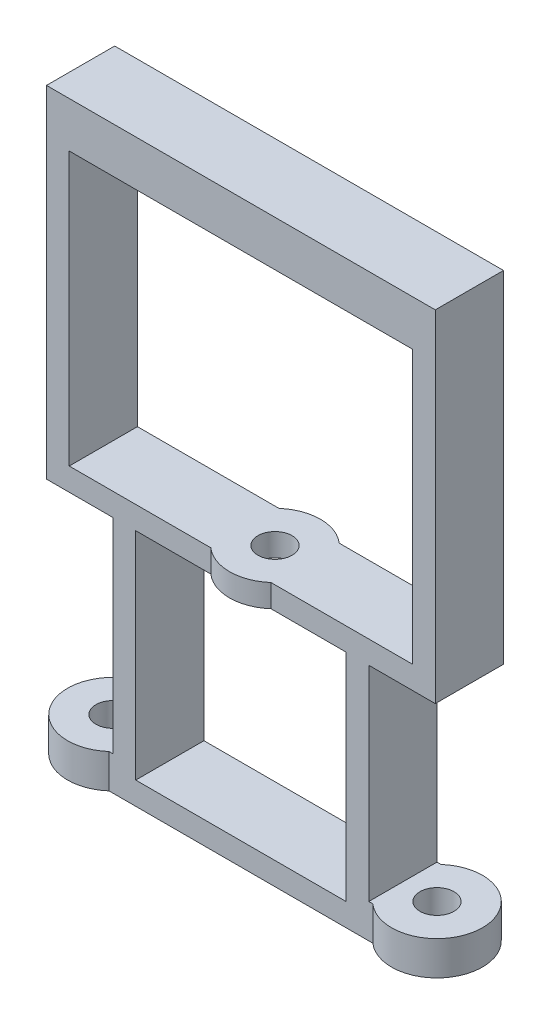
ISO-10303-21;
HEADER;
FILE_DESCRIPTION(('STEP AP214'),'2;1');
FILE_NAME('part.step','',(''),(''),'','','');
FILE_SCHEMA(('AUTOMOTIVE_DESIGN { 1 0 10303 214 1 1 1 1 }'));
ENDSEC;
DATA;
#1=APPLICATION_CONTEXT('core data for automotive mechanical design processes');
#2=APPLICATION_PROTOCOL_DEFINITION('international standard','automotive_design',2000,#1);
#3=PRODUCT_CONTEXT('',#1,'mechanical');
#4=PRODUCT('Part','Part','',(#3));
#5=PRODUCT_RELATED_PRODUCT_CATEGORY('part','',(#4));
#6=PRODUCT_DEFINITION_FORMATION('','',#4);
#7=PRODUCT_DEFINITION_CONTEXT('part definition',#1,'design');
#8=PRODUCT_DEFINITION('design','',#6,#7);
#9=PRODUCT_DEFINITION_SHAPE('','',#8);
#10=(LENGTH_UNIT() NAMED_UNIT(*) SI_UNIT(.MILLI.,.METRE.));
#11=(NAMED_UNIT(*) PLANE_ANGLE_UNIT() SI_UNIT($,.RADIAN.));
#12=(NAMED_UNIT(*) SI_UNIT($,.STERADIAN.) SOLID_ANGLE_UNIT());
#13=UNCERTAINTY_MEASURE_WITH_UNIT(LENGTH_MEASURE(1.E-05),#10,'distance_accuracy_value','');
#14=(GEOMETRIC_REPRESENTATION_CONTEXT(3) GLOBAL_UNCERTAINTY_ASSIGNED_CONTEXT((#13)) GLOBAL_UNIT_ASSIGNED_CONTEXT((#10,
#11,#12)) REPRESENTATION_CONTEXT('',''));
#15=CARTESIAN_POINT('',(0.,0.,0.));
#16=DIRECTION('',(0.,0.,1.));
#17=DIRECTION('',(1.,0.,0.));
#18=AXIS2_PLACEMENT_3D('',#15,#16,#17);
#19=CARTESIAN_POINT('',(-0.85,51.,3.));
#20=DIRECTION('',(-1.,0.,0.));
#21=DIRECTION('',(0.,0.,1.));
#22=AXIS2_PLACEMENT_3D('',#19,#20,#21);
#23=PLANE('',#22);
#24=DIRECTION('',(0.,0.,-1.));
#25=VECTOR('',#24,1.);
#26=CARTESIAN_POINT('',(-0.85,47.,3.));
#27=LINE('',#26,#25);
#28=CARTESIAN_POINT('',(-0.85,47.,3.));
#29=VERTEX_POINT('',#28);
#30=CARTESIAN_POINT('',(-0.85,47.,-2.99999999999994));
#31=VERTEX_POINT('',#30);
#32=EDGE_CURVE('E252',#29,#31,#27,.T.);
#33=ORIENTED_EDGE('',*,*,#32,.F.);
#34=DIRECTION('',(0.,-1.,0.));
#35=VECTOR('',#34,1.);
#36=CARTESIAN_POINT('',(-0.85,51.,3.));
#37=LINE('',#36,#35);
#38=CARTESIAN_POINT('',(-0.849999999999999,23.,3.));
#39=VERTEX_POINT('',#38);
#40=EDGE_CURVE('E100',#29,#39,#37,.T.);
#41=ORIENTED_EDGE('',*,*,#40,.T.);
#42=DIRECTION('',(0.,0.,-1.));
#43=VECTOR('',#42,1.);
#44=CARTESIAN_POINT('',(-0.85,23.,3.));
#45=LINE('',#44,#43);
#46=CARTESIAN_POINT('',(-0.85,23.,-3.));
#47=VERTEX_POINT('',#46);
#48=EDGE_CURVE('E291',#39,#47,#45,.T.);
#49=ORIENTED_EDGE('',*,*,#48,.T.);
#50=DIRECTION('',(0.,-1.,0.));
#51=VECTOR('',#50,1.);
#52=CARTESIAN_POINT('',(-0.85,51.,-3.));
#53=LINE('',#52,#51);
#54=EDGE_CURVE('E302',#31,#47,#53,.T.);
#55=ORIENTED_EDGE('',*,*,#54,.F.);
#56=EDGE_LOOP('',(#33,#41,#49,#55));
#57=FACE_BOUND('',#56,.T.);
#58=ADVANCED_FACE('F84',(#57),#23,.F.);
#59=CARTESIAN_POINT('',(29.35,51.,-2.99999999999994));
#60=DIRECTION('',(1.,0.,0.));
#61=DIRECTION('',(0.,0.,-1.));
#62=AXIS2_PLACEMENT_3D('',#59,#60,#61);
#63=PLANE('',#62);
#64=DIRECTION('',(0.,0.,1.));
#65=VECTOR('',#64,1.);
#66=CARTESIAN_POINT('',(29.35,47.,-2.99999999999994));
#67=LINE('',#66,#65);
#68=CARTESIAN_POINT('',(29.35,47.,-2.99999999999994));
#69=VERTEX_POINT('',#68);
#70=CARTESIAN_POINT('',(29.35,47.,3.));
#71=VERTEX_POINT('',#70);
#72=EDGE_CURVE('E250',#69,#71,#67,.T.);
#73=ORIENTED_EDGE('',*,*,#72,.F.);
#74=DIRECTION('',(0.,-1.,0.));
#75=VECTOR('',#74,1.);
#76=CARTESIAN_POINT('',(29.35,51.,-2.99999999999994));
#77=LINE('',#76,#75);
#78=CARTESIAN_POINT('',(29.35,23.,-2.99999999999994));
#79=VERTEX_POINT('',#78);
#80=EDGE_CURVE('E262',#69,#79,#77,.T.);
#81=ORIENTED_EDGE('',*,*,#80,.T.);
#82=DIRECTION('',(0.,0.,1.));
#83=VECTOR('',#82,1.);
#84=CARTESIAN_POINT('',(29.35,23.,-2.99999999999994));
#85=LINE('',#84,#83);
#86=CARTESIAN_POINT('',(29.35,23.,3.));
#87=VERTEX_POINT('',#86);
#88=EDGE_CURVE('E546',#79,#87,#85,.T.);
#89=ORIENTED_EDGE('',*,*,#88,.T.);
#90=DIRECTION('',(0.,-1.,0.));
#91=VECTOR('',#90,1.);
#92=CARTESIAN_POINT('',(29.35,51.,3.));
#93=LINE('',#92,#91);
#94=EDGE_CURVE('E264',#71,#87,#93,.T.);
#95=ORIENTED_EDGE('',*,*,#94,.F.);
#96=EDGE_LOOP('',(#73,#81,#89,#95));
#97=FACE_BOUND('',#96,.T.);
#98=ADVANCED_FACE('F260',(#97),#63,.F.);
#99=CARTESIAN_POINT('',(0.,23.,0.));
#100=DIRECTION('',(0.,1.,0.));
#101=DIRECTION('',(0.,0.,1.));
#102=AXIS2_PLACEMENT_3D('',#99,#100,#101);
#103=PLANE('',#102);
#104=CARTESIAN_POINT('',(14.25,23.,0.));
#105=DIRECTION('',(0.,1.,0.));
#106=DIRECTION('',(0.,0.,1.));
#107=AXIS2_PLACEMENT_3D('',#104,#105,#106);
#108=CIRCLE('',#107,1.5);
#109=CARTESIAN_POINT('',(14.25,23.,1.5));
#110=VERTEX_POINT('',#109);
#111=EDGE_CURVE('E320',#110,#110,#108,.T.);
#112=ORIENTED_EDGE('',*,*,#111,.F.);
#113=EDGE_LOOP('',(#112));
#114=FACE_BOUND('',#113,.T.);
#115=DIRECTION('',(1.,0.,0.));
#116=VECTOR('',#115,1.);
#117=CARTESIAN_POINT('',(3.,23.,3.));
#118=LINE('',#117,#116);
#119=CARTESIAN_POINT('',(16.8957513110646,23.,3.));
#120=VERTEX_POINT('',#119);
#121=EDGE_CURVE('E424',#120,#87,#118,.T.);
#122=ORIENTED_EDGE('',*,*,#121,.T.);
#123=ORIENTED_EDGE('',*,*,#88,.F.);
#124=DIRECTION('',(-1.,0.,0.));
#125=VECTOR('',#124,1.);
#126=CARTESIAN_POINT('',(3.,23.,-3.));
#127=LINE('',#126,#125);
#128=CARTESIAN_POINT('',(16.8957513110646,23.,-3.));
#129=VERTEX_POINT('',#128);
#130=EDGE_CURVE('E271',#79,#129,#127,.T.);
#131=ORIENTED_EDGE('',*,*,#130,.T.);
#132=CARTESIAN_POINT('',(14.25,23.,0.));
#133=DIRECTION('',(0.,1.,0.));
#134=DIRECTION('',(0.,0.,1.));
#135=AXIS2_PLACEMENT_3D('',#132,#133,#134);
#136=CIRCLE('',#135,4.);
#137=CARTESIAN_POINT('',(11.6042486889354,23.,-3.));
#138=VERTEX_POINT('',#137);
#139=EDGE_CURVE('E325',#129,#138,#136,.T.);
#140=ORIENTED_EDGE('',*,*,#139,.T.);
#141=EDGE_CURVE('E423',#138,#47,#127,.T.);
#142=ORIENTED_EDGE('',*,*,#141,.T.);
#143=ORIENTED_EDGE('',*,*,#48,.F.);
#144=CARTESIAN_POINT('',(11.6042486889354,23.,3.));
#145=VERTEX_POINT('',#144);
#146=EDGE_CURVE('E420',#39,#145,#118,.T.);
#147=ORIENTED_EDGE('',*,*,#146,.T.);
#148=CARTESIAN_POINT('',(14.25,23.,0.));
#149=DIRECTION('',(0.,1.,0.));
#150=DIRECTION('',(0.,0.,1.));
#151=AXIS2_PLACEMENT_3D('',#148,#149,#150);
#152=CIRCLE('',#151,4.);
#153=EDGE_CURVE('E359',#145,#120,#152,.T.);
#154=ORIENTED_EDGE('',*,*,#153,.T.);
#155=EDGE_LOOP('',(#122,#123,#131,#140,#142,#143,#147,#154));
#156=FACE_BOUND('',#155,.T.);
#157=ADVANCED_FACE('F559',(#114,#156),#103,.T.);
#158=CARTESIAN_POINT('',(3.,23.,-3.));
#159=DIRECTION('',(1.,0.,0.));
#160=DIRECTION('',(0.,0.,-1.));
#161=AXIS2_PLACEMENT_3D('',#158,#159,#160);
#162=PLANE('',#161);
#163=DIRECTION('',(0.,0.,1.));
#164=VECTOR('',#163,1.);
#165=CARTESIAN_POINT('',(3.,21.,-3.));
#166=LINE('',#165,#164);
#167=CARTESIAN_POINT('',(3.,21.,-3.));
#168=VERTEX_POINT('',#167);
#169=CARTESIAN_POINT('',(3.,21.,3.));
#170=VERTEX_POINT('',#169);
#171=EDGE_CURVE('E108',#168,#170,#166,.T.);
#172=ORIENTED_EDGE('',*,*,#171,.F.);
#173=DIRECTION('',(0.,-1.,0.));
#174=VECTOR('',#173,1.);
#175=CARTESIAN_POINT('',(3.,23.,-3.));
#176=LINE('',#175,#174);
#177=CARTESIAN_POINT('',(3.,3.,-3.));
#178=VERTEX_POINT('',#177);
#179=EDGE_CURVE('E427',#168,#178,#176,.T.);
#180=ORIENTED_EDGE('',*,*,#179,.T.);
#181=DIRECTION('',(0.,0.,1.));
#182=VECTOR('',#181,1.);
#183=CARTESIAN_POINT('',(3.,3.,-3.));
#184=LINE('',#183,#182);
#185=CARTESIAN_POINT('',(3.,3.,3.));
#186=VERTEX_POINT('',#185);
#187=EDGE_CURVE('E419',#178,#186,#184,.T.);
#188=ORIENTED_EDGE('',*,*,#187,.T.);
#189=DIRECTION('',(0.,-1.,0.));
#190=VECTOR('',#189,1.);
#191=CARTESIAN_POINT('',(3.,23.,3.));
#192=LINE('',#191,#190);
#193=EDGE_CURVE('E443',#170,#186,#192,.T.);
#194=ORIENTED_EDGE('',*,*,#193,.F.);
#195=EDGE_LOOP('',(#172,#180,#188,#194));
#196=FACE_BOUND('',#195,.T.);
#197=ADVANCED_FACE('F580',(#196),#162,.F.);
#198=CARTESIAN_POINT('',(25.5,23.,-3.));
#199=DIRECTION('',(-1.,0.,0.));
#200=DIRECTION('',(0.,0.,1.));
#201=AXIS2_PLACEMENT_3D('',#198,#199,#200);
#202=PLANE('',#201);
#203=DIRECTION('',(0.,0.,-1.));
#204=VECTOR('',#203,1.);
#205=CARTESIAN_POINT('',(25.5,21.,-3.));
#206=LINE('',#205,#204);
#207=CARTESIAN_POINT('',(25.5,21.,3.));
#208=VERTEX_POINT('',#207);
#209=CARTESIAN_POINT('',(25.5,21.,-3.));
#210=VERTEX_POINT('',#209);
#211=EDGE_CURVE('E353',#208,#210,#206,.T.);
#212=ORIENTED_EDGE('',*,*,#211,.F.);
#213=DIRECTION('',(0.,-1.,0.));
#214=VECTOR('',#213,1.);
#215=CARTESIAN_POINT('',(25.5,23.,3.));
#216=LINE('',#215,#214);
#217=CARTESIAN_POINT('',(25.5,3.,3.));
#218=VERTEX_POINT('',#217);
#219=EDGE_CURVE('E440',#208,#218,#216,.T.);
#220=ORIENTED_EDGE('',*,*,#219,.T.);
#221=DIRECTION('',(0.,0.,-1.));
#222=VECTOR('',#221,1.);
#223=CARTESIAN_POINT('',(25.5,3.,-3.));
#224=LINE('',#223,#222);
#225=CARTESIAN_POINT('',(25.5,3.,-3.));
#226=VERTEX_POINT('',#225);
#227=EDGE_CURVE('E431',#218,#226,#224,.T.);
#228=ORIENTED_EDGE('',*,*,#227,.T.);
#229=DIRECTION('',(0.,-1.,0.));
#230=VECTOR('',#229,1.);
#231=CARTESIAN_POINT('',(25.5,23.,-3.));
#232=LINE('',#231,#230);
#233=EDGE_CURVE('E437',#210,#226,#232,.T.);
#234=ORIENTED_EDGE('',*,*,#233,.F.);
#235=EDGE_LOOP('',(#212,#220,#228,#234));
#236=FACE_BOUND('',#235,.T.);
#237=ADVANCED_FACE('F577',(#236),#202,.F.);
#238=CARTESIAN_POINT('',(0.,3.,0.));
#239=DIRECTION('',(0.,1.,0.));
#240=DIRECTION('',(0.,0.,1.));
#241=AXIS2_PLACEMENT_3D('',#238,#239,#240);
#242=PLANE('',#241);
#243=ORIENTED_EDGE('',*,*,#187,.F.);
#244=DIRECTION('',(1.,0.,0.));
#245=VECTOR('',#244,1.);
#246=CARTESIAN_POINT('',(0.,3.,-3.));
#247=LINE('',#246,#245);
#248=CARTESIAN_POINT('',(2.64575131106459,3.,-3.));
#249=VERTEX_POINT('',#248);
#250=EDGE_CURVE('E461',#249,#178,#247,.T.);
#251=ORIENTED_EDGE('',*,*,#250,.F.);
#252=CARTESIAN_POINT('',(0.,3.,0.));
#253=DIRECTION('',(0.,1.,0.));
#254=DIRECTION('',(0.,0.,1.));
#255=AXIS2_PLACEMENT_3D('',#252,#253,#254);
#256=CIRCLE('',#255,4.);
#257=CARTESIAN_POINT('',(2.64575131106459,3.,3.));
#258=VERTEX_POINT('',#257);
#259=EDGE_CURVE('E465',#249,#258,#256,.T.);
#260=ORIENTED_EDGE('',*,*,#259,.T.);
#261=DIRECTION('',(-1.,0.,0.));
#262=VECTOR('',#261,1.);
#263=CARTESIAN_POINT('',(0.,3.,3.));
#264=LINE('',#263,#262);
#265=EDGE_CURVE('E469',#186,#258,#264,.T.);
#266=ORIENTED_EDGE('',*,*,#265,.F.);
#267=EDGE_LOOP('',(#243,#251,#260,#266));
#268=FACE_BOUND('',#267,.T.);
#269=CARTESIAN_POINT('',(0.,3.,0.));
#270=DIRECTION('',(0.,1.,0.));
#271=DIRECTION('',(0.,0.,1.));
#272=AXIS2_PLACEMENT_3D('',#269,#270,#271);
#273=CIRCLE('',#272,1.5);
#274=CARTESIAN_POINT('',(0.,3.,1.5));
#275=VERTEX_POINT('',#274);
#276=EDGE_CURVE('E447',#275,#275,#273,.T.);
#277=ORIENTED_EDGE('',*,*,#276,.F.);
#278=EDGE_LOOP('',(#277));
#279=FACE_BOUND('',#278,.T.);
#280=ADVANCED_FACE('F526',(#268,#279),#242,.T.);
#281=CARTESIAN_POINT('',(28.5,3.,0.));
#282=DIRECTION('',(0.,-1.,0.));
#283=DIRECTION('',(0.,0.,-1.));
#284=AXIS2_PLACEMENT_3D('',#281,#282,#283);
#285=CYLINDRICAL_SURFACE('',#284,4.);
#286=CARTESIAN_POINT('',(28.5,0.,0.));
#287=DIRECTION('',(0.,1.,0.));
#288=DIRECTION('',(0.,0.,1.));
#289=AXIS2_PLACEMENT_3D('',#286,#287,#288);
#290=CIRCLE('',#289,4.);
#291=CARTESIAN_POINT('',(25.8542486889354,0.,3.));
#292=VERTEX_POINT('',#291);
#293=CARTESIAN_POINT('',(25.8542486889354,0.,-3.));
#294=VERTEX_POINT('',#293);
#295=EDGE_CURVE('E482',#292,#294,#290,.T.);
#296=ORIENTED_EDGE('',*,*,#295,.T.);
#297=DIRECTION('',(0.,-1.,0.));
#298=VECTOR('',#297,1.);
#299=CARTESIAN_POINT('',(25.8542486889354,3.,-3.));
#300=LINE('',#299,#298);
#301=CARTESIAN_POINT('',(25.8542486889354,3.,-3.));
#302=VERTEX_POINT('',#301);
#303=EDGE_CURVE('E12',#302,#294,#300,.T.);
#304=ORIENTED_EDGE('',*,*,#303,.F.);
#305=CARTESIAN_POINT('',(28.5,3.,0.));
#306=DIRECTION('',(0.,1.,0.));
#307=DIRECTION('',(0.,0.,1.));
#308=AXIS2_PLACEMENT_3D('',#305,#306,#307);
#309=CIRCLE('',#308,4.);
#310=CARTESIAN_POINT('',(25.8542486889354,3.,3.));
#311=VERTEX_POINT('',#310);
#312=EDGE_CURVE('E456',#311,#302,#309,.T.);
#313=ORIENTED_EDGE('',*,*,#312,.F.);
#314=DIRECTION('',(0.,-1.,0.));
#315=VECTOR('',#314,1.);
#316=CARTESIAN_POINT('',(25.8542486889354,3.,3.));
#317=LINE('',#316,#315);
#318=EDGE_CURVE('E474',#311,#292,#317,.T.);
#319=ORIENTED_EDGE('',*,*,#318,.T.);
#320=EDGE_LOOP('',(#296,#304,#313,#319));
#321=FACE_BOUND('',#320,.T.);
#322=ADVANCED_FACE('F518',(#321),#285,.T.);
#323=CARTESIAN_POINT('',(0.,3.,-3.));
#324=DIRECTION('',(0.,0.,-1.));
#325=DIRECTION('',(-1.,0.,0.));
#326=AXIS2_PLACEMENT_3D('',#323,#324,#325);
#327=PLANE('',#326);
#328=DIRECTION('',(1.,0.,0.));
#329=VECTOR('',#328,1.);
#330=CARTESIAN_POINT('',(-1.65000000000001,47.,-2.99999999999994));
#331=LINE('',#330,#329);
#332=EDGE_CURVE('E247',#31,#69,#331,.T.);
#333=ORIENTED_EDGE('',*,*,#332,.F.);
#334=ORIENTED_EDGE('',*,*,#54,.T.);
#335=ORIENTED_EDGE('',*,*,#141,.F.);
#336=DIRECTION('',(0.,1.,0.));
#337=VECTOR('',#336,1.);
#338=CARTESIAN_POINT('',(11.6042486889354,21.,-3.));
#339=LINE('',#338,#337);
#340=CARTESIAN_POINT('',(11.6042486889354,21.,-3.));
#341=VERTEX_POINT('',#340);
#342=EDGE_CURVE('E347',#138,#341,#339,.F.);
#343=ORIENTED_EDGE('',*,*,#342,.T.);
#344=DIRECTION('',(1.,0.,0.));
#345=VECTOR('',#344,1.);
#346=CARTESIAN_POINT('',(0.,21.,-3.));
#347=LINE('',#346,#345);
#348=CARTESIAN_POINT('',(5.,21.,-3.));
#349=VERTEX_POINT('',#348);
#350=EDGE_CURVE('E412',#349,#341,#347,.T.);
#351=ORIENTED_EDGE('',*,*,#350,.F.);
#352=DIRECTION('',(0.,1.,0.));
#353=VECTOR('',#352,1.);
#354=CARTESIAN_POINT('',(5.,3.,-3.));
#355=LINE('',#354,#353);
#356=CARTESIAN_POINT('',(5.,2.,-3.));
#357=VERTEX_POINT('',#356);
#358=EDGE_CURVE('E416',#357,#349,#355,.T.);
#359=ORIENTED_EDGE('',*,*,#358,.F.);
#360=DIRECTION('',(-1.,0.,0.));
#361=VECTOR('',#360,1.);
#362=CARTESIAN_POINT('',(0.,2.,-3.));
#363=LINE('',#362,#361);
#364=CARTESIAN_POINT('',(23.5,2.,-3.));
#365=VERTEX_POINT('',#364);
#366=EDGE_CURVE('E395',#365,#357,#363,.T.);
#367=ORIENTED_EDGE('',*,*,#366,.F.);
#368=DIRECTION('',(0.,-1.,0.));
#369=VECTOR('',#368,1.);
#370=CARTESIAN_POINT('',(23.5,3.,-3.));
#371=LINE('',#370,#369);
#372=CARTESIAN_POINT('',(23.5,21.,-3.));
#373=VERTEX_POINT('',#372);
#374=EDGE_CURVE('E407',#373,#365,#371,.T.);
#375=ORIENTED_EDGE('',*,*,#374,.F.);
#376=CARTESIAN_POINT('',(16.8957513110646,21.,-3.));
#377=VERTEX_POINT('',#376);
#378=EDGE_CURVE('E411',#377,#373,#347,.T.);
#379=ORIENTED_EDGE('',*,*,#378,.F.);
#380=DIRECTION('',(0.,1.,0.));
#381=VECTOR('',#380,1.);
#382=CARTESIAN_POINT('',(16.8957513110646,21.,-3.));
#383=LINE('',#382,#381);
#384=EDGE_CURVE('E350',#377,#129,#383,.T.);
#385=ORIENTED_EDGE('',*,*,#384,.T.);
#386=ORIENTED_EDGE('',*,*,#130,.F.);
#387=ORIENTED_EDGE('',*,*,#80,.F.);
#388=EDGE_LOOP('',(#333,#334,#335,#343,#351,#359,#367,#375,#379,#385,#386,#387));
#389=FACE_BOUND('',#388,.T.);
#390=DIRECTION('',(0.,-1.,0.));
#391=VECTOR('',#390,1.);
#392=CARTESIAN_POINT('',(-2.85,23.,-3.));
#393=LINE('',#392,#391);
#394=CARTESIAN_POINT('',(-2.85,51.,-3.));
#395=VERTEX_POINT('',#394);
#396=CARTESIAN_POINT('',(-2.85,21.,-3.));
#397=VERTEX_POINT('',#396);
#398=EDGE_CURVE('E309',#395,#397,#393,.T.);
#399=ORIENTED_EDGE('',*,*,#398,.F.);
#400=DIRECTION('',(-1.,0.,0.));
#401=VECTOR('',#400,1.);
#402=CARTESIAN_POINT('',(-2.85,51.,-3.));
#403=LINE('',#402,#401);
#404=CARTESIAN_POINT('',(31.35,51.,-2.99999999999994));
#405=VERTEX_POINT('',#404);
#406=EDGE_CURVE('E299',#405,#395,#403,.T.);
#407=ORIENTED_EDGE('',*,*,#406,.F.);
#408=DIRECTION('',(0.,1.,0.));
#409=VECTOR('',#408,1.);
#410=CARTESIAN_POINT('',(31.35,21.,-2.99999999999994));
#411=LINE('',#410,#409);
#412=CARTESIAN_POINT('',(31.35,21.,-2.99999999999994));
#413=VERTEX_POINT('',#412);
#414=EDGE_CURVE('E287',#413,#405,#411,.T.);
#415=ORIENTED_EDGE('',*,*,#414,.F.);
#416=DIRECTION('',(1.,0.,0.));
#417=VECTOR('',#416,1.);
#418=CARTESIAN_POINT('',(0.,21.,-3.));
#419=LINE('',#418,#417);
#420=EDGE_CURVE('E334',#210,#413,#419,.T.);
#421=ORIENTED_EDGE('',*,*,#420,.F.);
#422=ORIENTED_EDGE('',*,*,#233,.T.);
#423=EDGE_CURVE('E460',#226,#302,#247,.T.);
#424=ORIENTED_EDGE('',*,*,#423,.T.);
#425=ORIENTED_EDGE('',*,*,#303,.T.);
#426=DIRECTION('',(1.,0.,0.));
#427=VECTOR('',#426,1.);
#428=CARTESIAN_POINT('',(0.,0.,-3.));
#429=LINE('',#428,#427);
#430=CARTESIAN_POINT('',(2.64575131106459,0.,-3.));
#431=VERTEX_POINT('',#430);
#432=EDGE_CURVE('E486',#431,#294,#429,.T.);
#433=ORIENTED_EDGE('',*,*,#432,.F.);
#434=DIRECTION('',(0.,-1.,0.));
#435=VECTOR('',#434,1.);
#436=CARTESIAN_POINT('',(2.64575131106459,3.,-3.));
#437=LINE('',#436,#435);
#438=EDGE_CURVE('E93',#249,#431,#437,.T.);
#439=ORIENTED_EDGE('',*,*,#438,.F.);
#440=ORIENTED_EDGE('',*,*,#250,.T.);
#441=ORIENTED_EDGE('',*,*,#179,.F.);
#442=EDGE_CURVE('E329',#397,#168,#419,.T.);
#443=ORIENTED_EDGE('',*,*,#442,.F.);
#444=EDGE_LOOP('',(#399,#407,#415,#421,#422,#424,#425,#433,#439,#440,#441,#443));
#445=FACE_BOUND('',#444,.T.);
#446=ADVANCED_FACE('F268',(#389,#445),#327,.T.);
#447=CARTESIAN_POINT('',(0.,3.,0.));
#448=DIRECTION('',(0.,-1.,0.));
#449=DIRECTION('',(0.,0.,-1.));
#450=AXIS2_PLACEMENT_3D('',#447,#448,#449);
#451=CYLINDRICAL_SURFACE('',#450,4.);
#452=CARTESIAN_POINT('',(0.,0.,0.));
#453=DIRECTION('',(0.,1.,0.));
#454=DIRECTION('',(0.,0.,1.));
#455=AXIS2_PLACEMENT_3D('',#452,#453,#454);
#456=CIRCLE('',#455,4.);
#457=CARTESIAN_POINT('',(2.64575131106459,0.,3.));
#458=VERTEX_POINT('',#457);
#459=EDGE_CURVE('E490',#431,#458,#456,.T.);
#460=ORIENTED_EDGE('',*,*,#459,.T.);
#461=DIRECTION('',(0.,-1.,0.));
#462=VECTOR('',#461,1.);
#463=CARTESIAN_POINT('',(2.64575131106459,3.,3.));
#464=LINE('',#463,#462);
#465=EDGE_CURVE('E499',#258,#458,#464,.T.);
#466=ORIENTED_EDGE('',*,*,#465,.F.);
#467=ORIENTED_EDGE('',*,*,#259,.F.);
#468=ORIENTED_EDGE('',*,*,#438,.T.);
#469=EDGE_LOOP('',(#460,#466,#467,#468));
#470=FACE_BOUND('',#469,.T.);
#471=ADVANCED_FACE('F505',(#470),#451,.T.);
#472=CARTESIAN_POINT('',(28.5,3.,0.));
#473=DIRECTION('',(0.,-1.,0.));
#474=DIRECTION('',(0.,0.,-1.));
#475=AXIS2_PLACEMENT_3D('',#472,#473,#474);
#476=CYLINDRICAL_SURFACE('',#475,1.5);
#477=CARTESIAN_POINT('',(28.5,3.,0.));
#478=DIRECTION('',(0.,1.,0.));
#479=DIRECTION('',(0.,0.,1.));
#480=AXIS2_PLACEMENT_3D('',#477,#478,#479);
#481=CIRCLE('',#480,1.5);
#482=CARTESIAN_POINT('',(28.5,3.,1.5));
#483=VERTEX_POINT('',#482);
#484=EDGE_CURVE('E451',#483,#483,#481,.T.);
#485=ORIENTED_EDGE('',*,*,#484,.T.);
#486=EDGE_LOOP('',(#485));
#487=FACE_BOUND('',#486,.T.);
#488=CARTESIAN_POINT('',(28.5,0.,0.));
#489=DIRECTION('',(0.,1.,0.));
#490=DIRECTION('',(0.,0.,1.));
#491=AXIS2_PLACEMENT_3D('',#488,#489,#490);
#492=CIRCLE('',#491,1.5);
#493=CARTESIAN_POINT('',(28.5,0.,1.5));
#494=VERTEX_POINT('',#493);
#495=EDGE_CURVE('E478',#494,#494,#492,.T.);
#496=ORIENTED_EDGE('',*,*,#495,.F.);
#497=EDGE_LOOP('',(#496));
#498=FACE_BOUND('',#497,.T.);
#499=ADVANCED_FACE('F762',(#487,#498),#476,.F.);
#500=CARTESIAN_POINT('',(0.,3.,0.));
#501=DIRECTION('',(0.,-1.,0.));
#502=DIRECTION('',(0.,0.,-1.));
#503=AXIS2_PLACEMENT_3D('',#500,#501,#502);
#504=CYLINDRICAL_SURFACE('',#503,1.5);
#505=ORIENTED_EDGE('',*,*,#276,.T.);
#506=EDGE_LOOP('',(#505));
#507=FACE_BOUND('',#506,.T.);
#508=CARTESIAN_POINT('',(0.,0.,0.));
#509=DIRECTION('',(0.,1.,0.));
#510=DIRECTION('',(0.,0.,1.));
#511=AXIS2_PLACEMENT_3D('',#508,#509,#510);
#512=CIRCLE('',#511,1.5);
#513=CARTESIAN_POINT('',(0.,0.,1.5));
#514=VERTEX_POINT('',#513);
#515=EDGE_CURVE('E446',#514,#514,#512,.T.);
#516=ORIENTED_EDGE('',*,*,#515,.F.);
#517=EDGE_LOOP('',(#516));
#518=FACE_BOUND('',#517,.T.);
#519=ADVANCED_FACE('F86',(#507,#518),#504,.F.);
#520=CARTESIAN_POINT('',(0.,3.,3.));
#521=DIRECTION('',(0.,0.,1.));
#522=DIRECTION('',(1.,0.,0.));
#523=AXIS2_PLACEMENT_3D('',#520,#521,#522);
#524=PLANE('',#523);
#525=ORIENTED_EDGE('',*,*,#40,.F.);
#526=DIRECTION('',(1.,0.,0.));
#527=VECTOR('',#526,1.);
#528=CARTESIAN_POINT('',(-1.65000000000001,47.,3.));
#529=LINE('',#528,#527);
#530=EDGE_CURVE('E257',#29,#71,#529,.T.);
#531=ORIENTED_EDGE('',*,*,#530,.T.);
#532=ORIENTED_EDGE('',*,*,#94,.T.);
#533=ORIENTED_EDGE('',*,*,#121,.F.);
#534=DIRECTION('',(0.,1.,0.));
#535=VECTOR('',#534,1.);
#536=CARTESIAN_POINT('',(16.8957513110646,21.,3.));
#537=LINE('',#536,#535);
#538=CARTESIAN_POINT('',(16.8957513110646,21.,3.));
#539=VERTEX_POINT('',#538);
#540=EDGE_CURVE('E343',#539,#120,#537,.T.);
#541=ORIENTED_EDGE('',*,*,#540,.F.);
#542=DIRECTION('',(-1.,0.,0.));
#543=VECTOR('',#542,1.);
#544=CARTESIAN_POINT('',(5.,21.,3.));
#545=LINE('',#544,#543);
#546=CARTESIAN_POINT('',(23.5,21.,3.));
#547=VERTEX_POINT('',#546);
#548=EDGE_CURVE('E386',#547,#539,#545,.T.);
#549=ORIENTED_EDGE('',*,*,#548,.F.);
#550=DIRECTION('',(0.,1.,0.));
#551=VECTOR('',#550,1.);
#552=CARTESIAN_POINT('',(23.5,2.,3.));
#553=LINE('',#552,#551);
#554=CARTESIAN_POINT('',(23.5,2.,3.));
#555=VERTEX_POINT('',#554);
#556=EDGE_CURVE('E381',#555,#547,#553,.T.);
#557=ORIENTED_EDGE('',*,*,#556,.F.);
#558=DIRECTION('',(1.,0.,0.));
#559=VECTOR('',#558,1.);
#560=CARTESIAN_POINT('',(5.,2.,3.));
#561=LINE('',#560,#559);
#562=CARTESIAN_POINT('',(5.,2.,3.));
#563=VERTEX_POINT('',#562);
#564=EDGE_CURVE('E377',#563,#555,#561,.T.);
#565=ORIENTED_EDGE('',*,*,#564,.F.);
#566=DIRECTION('',(0.,-1.,0.));
#567=VECTOR('',#566,1.);
#568=CARTESIAN_POINT('',(5.,2.,3.));
#569=LINE('',#568,#567);
#570=CARTESIAN_POINT('',(5.,21.,3.));
#571=VERTEX_POINT('',#570);
#572=EDGE_CURVE('E374',#571,#563,#569,.T.);
#573=ORIENTED_EDGE('',*,*,#572,.F.);
#574=CARTESIAN_POINT('',(11.6042486889354,21.,3.));
#575=VERTEX_POINT('',#574);
#576=EDGE_CURVE('E385',#575,#571,#545,.T.);
#577=ORIENTED_EDGE('',*,*,#576,.F.);
#578=DIRECTION('',(0.,1.,0.));
#579=VECTOR('',#578,1.);
#580=CARTESIAN_POINT('',(11.6042486889354,21.,3.));
#581=LINE('',#580,#579);
#582=EDGE_CURVE('E339',#145,#575,#581,.F.);
#583=ORIENTED_EDGE('',*,*,#582,.F.);
#584=ORIENTED_EDGE('',*,*,#146,.F.);
#585=EDGE_LOOP('',(#525,#531,#532,#533,#541,#549,#557,#565,#573,#577,#583,#584));
#586=FACE_BOUND('',#585,.T.);
#587=DIRECTION('',(0.,-1.,0.));
#588=VECTOR('',#587,1.);
#589=CARTESIAN_POINT('',(31.35,21.,3.00000000000001));
#590=LINE('',#589,#588);
#591=CARTESIAN_POINT('',(31.35,51.,3.));
#592=VERTEX_POINT('',#591);
#593=CARTESIAN_POINT('',(31.35,21.,3.00000000000001));
#594=VERTEX_POINT('',#593);
#595=EDGE_CURVE('E273',#592,#594,#590,.T.);
#596=ORIENTED_EDGE('',*,*,#595,.F.);
#597=DIRECTION('',(1.,0.,0.));
#598=VECTOR('',#597,1.);
#599=CARTESIAN_POINT('',(-2.85,51.,3.));
#600=LINE('',#599,#598);
#601=CARTESIAN_POINT('',(-2.85,51.,3.));
#602=VERTEX_POINT('',#601);
#603=EDGE_CURVE('E296',#602,#592,#600,.T.);
#604=ORIENTED_EDGE('',*,*,#603,.F.);
#605=DIRECTION('',(0.,1.,0.));
#606=VECTOR('',#605,1.);
#607=CARTESIAN_POINT('',(-2.85,23.,3.));
#608=LINE('',#607,#606);
#609=CARTESIAN_POINT('',(-2.85,21.,3.));
#610=VERTEX_POINT('',#609);
#611=EDGE_CURVE('E317',#610,#602,#608,.T.);
#612=ORIENTED_EDGE('',*,*,#611,.F.);
#613=DIRECTION('',(1.,0.,0.));
#614=VECTOR('',#613,1.);
#615=CARTESIAN_POINT('',(0.,21.,3.));
#616=LINE('',#615,#614);
#617=EDGE_CURVE('E335',#610,#170,#616,.T.);
#618=ORIENTED_EDGE('',*,*,#617,.T.);
#619=ORIENTED_EDGE('',*,*,#193,.T.);
#620=ORIENTED_EDGE('',*,*,#265,.T.);
#621=ORIENTED_EDGE('',*,*,#465,.T.);
#622=DIRECTION('',(-1.,0.,0.));
#623=VECTOR('',#622,1.);
#624=CARTESIAN_POINT('',(0.,0.,3.));
#625=LINE('',#624,#623);
#626=EDGE_CURVE('E452',#292,#458,#625,.T.);
#627=ORIENTED_EDGE('',*,*,#626,.F.);
#628=ORIENTED_EDGE('',*,*,#318,.F.);
#629=EDGE_CURVE('E470',#311,#218,#264,.T.);
#630=ORIENTED_EDGE('',*,*,#629,.T.);
#631=ORIENTED_EDGE('',*,*,#219,.F.);
#632=EDGE_CURVE('E333',#208,#594,#616,.T.);
#633=ORIENTED_EDGE('',*,*,#632,.T.);
#634=EDGE_LOOP('',(#596,#604,#612,#618,#619,#620,#621,#627,#628,#630,#631,#633));
#635=FACE_BOUND('',#634,.T.);
#636=ADVANCED_FACE('F521',(#586,#635),#524,.T.);
#637=ORIENTED_EDGE('',*,*,#227,.F.);
#638=ORIENTED_EDGE('',*,*,#629,.F.);
#639=ORIENTED_EDGE('',*,*,#312,.T.);
#640=ORIENTED_EDGE('',*,*,#423,.F.);
#641=EDGE_LOOP('',(#637,#638,#639,#640));
#642=FACE_BOUND('',#641,.T.);
#643=ORIENTED_EDGE('',*,*,#484,.F.);
#644=EDGE_LOOP('',(#643));
#645=FACE_BOUND('',#644,.T.);
#646=ADVANCED_FACE('F573',(#642,#645),#242,.T.);
#647=CARTESIAN_POINT('',(0.,0.,0.));
#648=DIRECTION('',(0.,1.,0.));
#649=DIRECTION('',(0.,0.,1.));
#650=AXIS2_PLACEMENT_3D('',#647,#648,#649);
#651=PLANE('',#650);
#652=ORIENTED_EDGE('',*,*,#515,.T.);
#653=EDGE_LOOP('',(#652));
#654=FACE_BOUND('',#653,.T.);
#655=ORIENTED_EDGE('',*,*,#495,.T.);
#656=EDGE_LOOP('',(#655));
#657=FACE_BOUND('',#656,.T.);
#658=ORIENTED_EDGE('',*,*,#295,.F.);
#659=ORIENTED_EDGE('',*,*,#626,.T.);
#660=ORIENTED_EDGE('',*,*,#459,.F.);
#661=ORIENTED_EDGE('',*,*,#432,.T.);
#662=EDGE_LOOP('',(#658,#659,#660,#661));
#663=FACE_BOUND('',#662,.T.);
#664=ADVANCED_FACE('F511',(#654,#657,#663),#651,.F.);
#665=CARTESIAN_POINT('',(5.,2.,-7.));
#666=DIRECTION('',(-1.,0.,0.));
#667=DIRECTION('',(0.,0.,1.));
#668=AXIS2_PLACEMENT_3D('',#665,#666,#667);
#669=PLANE('',#668);
#670=ORIENTED_EDGE('',*,*,#358,.T.);
#671=DIRECTION('',(0.,0.,1.));
#672=VECTOR('',#671,1.);
#673=CARTESIAN_POINT('',(5.,21.,-7.));
#674=LINE('',#673,#672);
#675=EDGE_CURVE('E391',#349,#571,#674,.T.);
#676=ORIENTED_EDGE('',*,*,#675,.T.);
#677=ORIENTED_EDGE('',*,*,#572,.T.);
#678=DIRECTION('',(0.,0.,1.));
#679=VECTOR('',#678,1.);
#680=CARTESIAN_POINT('',(5.,2.,-7.));
#681=LINE('',#680,#679);
#682=EDGE_CURVE('E390',#357,#563,#681,.T.);
#683=ORIENTED_EDGE('',*,*,#682,.F.);
#684=EDGE_LOOP('',(#670,#676,#677,#683));
#685=FACE_BOUND('',#684,.T.);
#686=ADVANCED_FACE('F618',(#685),#669,.F.);
#687=CARTESIAN_POINT('',(5.,21.,-7.));
#688=DIRECTION('',(0.,1.,0.));
#689=DIRECTION('',(0.,0.,1.));
#690=AXIS2_PLACEMENT_3D('',#687,#688,#689);
#691=PLANE('',#690);
#692=CARTESIAN_POINT('',(14.25,21.,0.));
#693=DIRECTION('',(0.,1.,0.));
#694=DIRECTION('',(0.,0.,1.));
#695=AXIS2_PLACEMENT_3D('',#692,#693,#694);
#696=CIRCLE('',#695,1.5);
#697=CARTESIAN_POINT('',(14.25,21.,1.5));
#698=VERTEX_POINT('',#697);
#699=EDGE_CURVE('E321',#698,#698,#696,.T.);
#700=ORIENTED_EDGE('',*,*,#699,.T.);
#701=EDGE_LOOP('',(#700));
#702=FACE_BOUND('',#701,.T.);
#703=ORIENTED_EDGE('',*,*,#350,.T.);
#704=CARTESIAN_POINT('',(14.25,21.,0.));
#705=DIRECTION('',(0.,1.,0.));
#706=DIRECTION('',(0.,0.,1.));
#707=AXIS2_PLACEMENT_3D('',#704,#705,#706);
#708=CIRCLE('',#707,4.);
#709=EDGE_CURVE('E354',#377,#341,#708,.T.);
#710=ORIENTED_EDGE('',*,*,#709,.F.);
#711=ORIENTED_EDGE('',*,*,#378,.T.);
#712=DIRECTION('',(0.,0.,1.));
#713=VECTOR('',#712,1.);
#714=CARTESIAN_POINT('',(23.5,21.,-7.));
#715=LINE('',#714,#713);
#716=EDGE_CURVE('E396',#373,#547,#715,.T.);
#717=ORIENTED_EDGE('',*,*,#716,.T.);
#718=ORIENTED_EDGE('',*,*,#548,.T.);
#719=CARTESIAN_POINT('',(14.25,21.,0.));
#720=DIRECTION('',(0.,1.,0.));
#721=DIRECTION('',(0.,0.,1.));
#722=AXIS2_PLACEMENT_3D('',#719,#720,#721);
#723=CIRCLE('',#722,4.);
#724=EDGE_CURVE('E358',#575,#539,#723,.T.);
#725=ORIENTED_EDGE('',*,*,#724,.F.);
#726=ORIENTED_EDGE('',*,*,#576,.T.);
#727=ORIENTED_EDGE('',*,*,#675,.F.);
#728=EDGE_LOOP('',(#703,#710,#711,#717,#718,#725,#726,#727));
#729=FACE_BOUND('',#728,.T.);
#730=ADVANCED_FACE('F614',(#702,#729),#691,.F.);
#731=CARTESIAN_POINT('',(23.5,2.,-7.));
#732=DIRECTION('',(1.,0.,0.));
#733=DIRECTION('',(0.,0.,-1.));
#734=AXIS2_PLACEMENT_3D('',#731,#732,#733);
#735=PLANE('',#734);
#736=ORIENTED_EDGE('',*,*,#374,.T.);
#737=DIRECTION('',(0.,0.,1.));
#738=VECTOR('',#737,1.);
#739=CARTESIAN_POINT('',(23.5,2.,-7.));
#740=LINE('',#739,#738);
#741=EDGE_CURVE('E399',#365,#555,#740,.T.);
#742=ORIENTED_EDGE('',*,*,#741,.T.);
#743=ORIENTED_EDGE('',*,*,#556,.T.);
#744=ORIENTED_EDGE('',*,*,#716,.F.);
#745=EDGE_LOOP('',(#736,#742,#743,#744));
#746=FACE_BOUND('',#745,.T.);
#747=ADVANCED_FACE('F617',(#746),#735,.F.);
#748=CARTESIAN_POINT('',(5.,2.,-7.));
#749=DIRECTION('',(0.,-1.,0.));
#750=DIRECTION('',(0.,0.,-1.));
#751=AXIS2_PLACEMENT_3D('',#748,#749,#750);
#752=PLANE('',#751);
#753=ORIENTED_EDGE('',*,*,#366,.T.);
#754=ORIENTED_EDGE('',*,*,#682,.T.);
#755=ORIENTED_EDGE('',*,*,#564,.T.);
#756=ORIENTED_EDGE('',*,*,#741,.F.);
#757=EDGE_LOOP('',(#753,#754,#755,#756));
#758=FACE_BOUND('',#757,.T.);
#759=ADVANCED_FACE('F622',(#758),#752,.F.);
#760=CARTESIAN_POINT('',(0.,21.,0.));
#761=DIRECTION('',(0.,1.,0.));
#762=DIRECTION('',(0.,0.,1.));
#763=AXIS2_PLACEMENT_3D('',#760,#761,#762);
#764=PLANE('',#763);
#765=ORIENTED_EDGE('',*,*,#632,.F.);
#766=ORIENTED_EDGE('',*,*,#211,.T.);
#767=ORIENTED_EDGE('',*,*,#420,.T.);
#768=DIRECTION('',(0.,0.,-1.));
#769=VECTOR('',#768,1.);
#770=CARTESIAN_POINT('',(31.35,21.,3.00000000000001));
#771=LINE('',#770,#769);
#772=EDGE_CURVE('E278',#594,#413,#771,.T.);
#773=ORIENTED_EDGE('',*,*,#772,.F.);
#774=EDGE_LOOP('',(#765,#766,#767,#773));
#775=FACE_BOUND('',#774,.T.);
#776=ADVANCED_FACE('F569',(#775),#764,.F.);
#777=ORIENTED_EDGE('',*,*,#442,.T.);
#778=ORIENTED_EDGE('',*,*,#171,.T.);
#779=ORIENTED_EDGE('',*,*,#617,.F.);
#780=DIRECTION('',(0.,0.,1.));
#781=VECTOR('',#780,1.);
#782=CARTESIAN_POINT('',(-2.85,21.,-3.));
#783=LINE('',#782,#781);
#784=EDGE_CURVE('E313',#397,#610,#783,.T.);
#785=ORIENTED_EDGE('',*,*,#784,.F.);
#786=EDGE_LOOP('',(#777,#778,#779,#785));
#787=FACE_BOUND('',#786,.T.);
#788=ADVANCED_FACE('F530',(#787),#764,.F.);
#789=CARTESIAN_POINT('',(14.25,21.,0.));
#790=DIRECTION('',(0.,1.,0.));
#791=DIRECTION('',(0.,0.,1.));
#792=AXIS2_PLACEMENT_3D('',#789,#790,#791);
#793=CYLINDRICAL_SURFACE('',#792,4.);
#794=ORIENTED_EDGE('',*,*,#153,.F.);
#795=ORIENTED_EDGE('',*,*,#582,.T.);
#796=ORIENTED_EDGE('',*,*,#724,.T.);
#797=ORIENTED_EDGE('',*,*,#540,.T.);
#798=EDGE_LOOP('',(#794,#795,#796,#797));
#799=FACE_BOUND('',#798,.T.);
#800=ADVANCED_FACE('F607',(#799),#793,.T.);
#801=CARTESIAN_POINT('',(14.25,21.,0.));
#802=DIRECTION('',(0.,1.,0.));
#803=DIRECTION('',(0.,0.,1.));
#804=AXIS2_PLACEMENT_3D('',#801,#802,#803);
#805=CYLINDRICAL_SURFACE('',#804,4.);
#806=ORIENTED_EDGE('',*,*,#139,.F.);
#807=ORIENTED_EDGE('',*,*,#384,.F.);
#808=ORIENTED_EDGE('',*,*,#709,.T.);
#809=ORIENTED_EDGE('',*,*,#342,.F.);
#810=EDGE_LOOP('',(#806,#807,#808,#809));
#811=FACE_BOUND('',#810,.T.);
#812=ADVANCED_FACE('F603',(#811),#805,.T.);
#813=CARTESIAN_POINT('',(14.25,21.,0.));
#814=DIRECTION('',(0.,1.,0.));
#815=DIRECTION('',(0.,0.,1.));
#816=AXIS2_PLACEMENT_3D('',#813,#814,#815);
#817=CYLINDRICAL_SURFACE('',#816,1.5);
#818=ORIENTED_EDGE('',*,*,#699,.F.);
#819=EDGE_LOOP('',(#818));
#820=FACE_BOUND('',#819,.T.);
#821=ORIENTED_EDGE('',*,*,#111,.T.);
#822=EDGE_LOOP('',(#821));
#823=FACE_BOUND('',#822,.T.);
#824=ADVANCED_FACE('F600',(#820,#823),#817,.F.);
#825=CARTESIAN_POINT('',(-2.85,0.,0.));
#826=DIRECTION('',(-1.,0.,0.));
#827=DIRECTION('',(0.,0.,1.));
#828=AXIS2_PLACEMENT_3D('',#825,#826,#827);
#829=PLANE('',#828);
#830=ORIENTED_EDGE('',*,*,#398,.T.);
#831=ORIENTED_EDGE('',*,*,#784,.T.);
#832=ORIENTED_EDGE('',*,*,#611,.T.);
#833=DIRECTION('',(0.,0.,1.));
#834=VECTOR('',#833,1.);
#835=CARTESIAN_POINT('',(-2.85,51.,3.));
#836=LINE('',#835,#834);
#837=EDGE_CURVE('E292',#395,#602,#836,.T.);
#838=ORIENTED_EDGE('',*,*,#837,.F.);
#839=EDGE_LOOP('',(#830,#831,#832,#838));
#840=FACE_BOUND('',#839,.T.);
#841=ADVANCED_FACE('F534',(#840),#829,.T.);
#842=CARTESIAN_POINT('',(0.,51.,0.));
#843=DIRECTION('',(0.,-1.,0.));
#844=DIRECTION('',(0.,0.,-1.));
#845=AXIS2_PLACEMENT_3D('',#842,#843,#844);
#846=PLANE('',#845);
#847=ORIENTED_EDGE('',*,*,#603,.T.);
#848=DIRECTION('',(0.,0.,-1.));
#849=VECTOR('',#848,1.);
#850=CARTESIAN_POINT('',(31.35,51.,-2.99999999999994));
#851=LINE('',#850,#849);
#852=EDGE_CURVE('E280',#592,#405,#851,.T.);
#853=ORIENTED_EDGE('',*,*,#852,.T.);
#854=ORIENTED_EDGE('',*,*,#406,.T.);
#855=ORIENTED_EDGE('',*,*,#837,.T.);
#856=EDGE_LOOP('',(#847,#853,#854,#855));
#857=FACE_BOUND('',#856,.T.);
#858=ADVANCED_FACE('F543',(#857),#846,.F.);
#859=CARTESIAN_POINT('',(31.35,0.,0.));
#860=DIRECTION('',(-1.,0.,0.));
#861=DIRECTION('',(0.,0.,1.));
#862=AXIS2_PLACEMENT_3D('',#859,#860,#861);
#863=PLANE('',#862);
#864=ORIENTED_EDGE('',*,*,#595,.T.);
#865=ORIENTED_EDGE('',*,*,#772,.T.);
#866=ORIENTED_EDGE('',*,*,#414,.T.);
#867=ORIENTED_EDGE('',*,*,#852,.F.);
#868=EDGE_LOOP('',(#864,#865,#866,#867));
#869=FACE_BOUND('',#868,.T.);
#870=ADVANCED_FACE('F541',(#869),#863,.F.);
#871=CARTESIAN_POINT('',(-1.65000000000001,47.,-2.99999999999994));
#872=DIRECTION('',(0.,1.,0.));
#873=DIRECTION('',(0.,0.,1.));
#874=AXIS2_PLACEMENT_3D('',#871,#872,#873);
#875=PLANE('',#874);
#876=ORIENTED_EDGE('',*,*,#530,.F.);
#877=ORIENTED_EDGE('',*,*,#32,.T.);
#878=ORIENTED_EDGE('',*,*,#332,.T.);
#879=ORIENTED_EDGE('',*,*,#72,.T.);
#880=EDGE_LOOP('',(#876,#877,#878,#879));
#881=FACE_BOUND('',#880,.T.);
#882=ADVANCED_FACE('F249',(#881),#875,.F.);
#883=CLOSED_SHELL('',(#58,#98,#157,#197,#237,#280,#322,#446,#471,#499,#519,#636,#646,#664,#686,
#730,#747,#759,#776,#788,#800,#812,#824,#841,#858,#870,#882));
#884=MANIFOLD_SOLID_BREP('B2',#883);
#885=ADVANCED_BREP_SHAPE_REPRESENTATION('',(#18,#884),#14);
#886=SHAPE_DEFINITION_REPRESENTATION(#9,#885);
ENDSEC;
END-ISO-10303-21;
